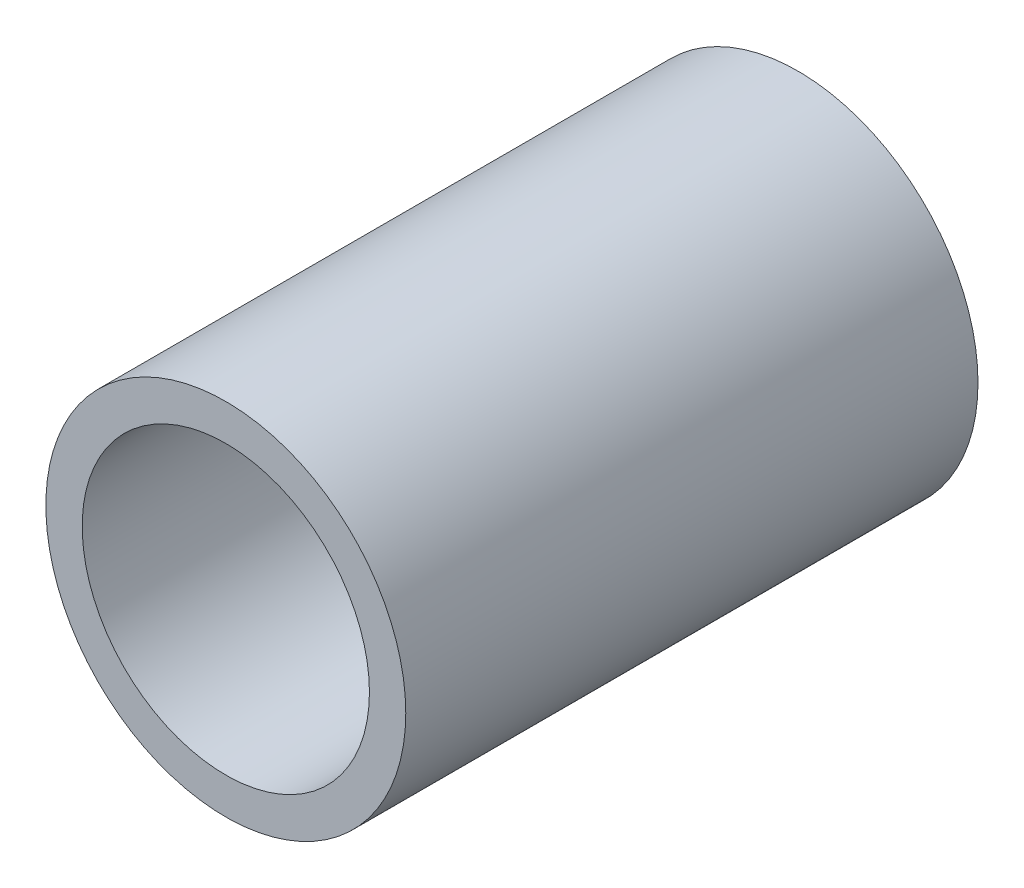
ISO-10303-21;
HEADER;
FILE_DESCRIPTION(('STEP AP214'),'2;1');
FILE_NAME('part.step','',(''),(''),'','','');
FILE_SCHEMA(('AUTOMOTIVE_DESIGN { 1 0 10303 214 1 1 1 1 }'));
ENDSEC;
DATA;
#1=APPLICATION_CONTEXT('core data for automotive mechanical design processes');
#2=APPLICATION_PROTOCOL_DEFINITION('international standard','automotive_design',2000,#1);
#3=PRODUCT_CONTEXT('',#1,'mechanical');
#4=PRODUCT('Part','Part','',(#3));
#5=PRODUCT_RELATED_PRODUCT_CATEGORY('part','',(#4));
#6=PRODUCT_DEFINITION_FORMATION('','',#4);
#7=PRODUCT_DEFINITION_CONTEXT('part definition',#1,'design');
#8=PRODUCT_DEFINITION('design','',#6,#7);
#9=PRODUCT_DEFINITION_SHAPE('','',#8);
#10=(LENGTH_UNIT() NAMED_UNIT(*) SI_UNIT(.MILLI.,.METRE.));
#11=(NAMED_UNIT(*) PLANE_ANGLE_UNIT() SI_UNIT($,.RADIAN.));
#12=(NAMED_UNIT(*) SI_UNIT($,.STERADIAN.) SOLID_ANGLE_UNIT());
#13=UNCERTAINTY_MEASURE_WITH_UNIT(LENGTH_MEASURE(1.E-05),#10,'distance_accuracy_value','');
#14=(GEOMETRIC_REPRESENTATION_CONTEXT(3) GLOBAL_UNCERTAINTY_ASSIGNED_CONTEXT((#13)) GLOBAL_UNIT_ASSIGNED_CONTEXT((#10,
#11,#12)) REPRESENTATION_CONTEXT('',''));
#15=CARTESIAN_POINT('',(0.,0.,0.));
#16=DIRECTION('',(0.,0.,1.));
#17=DIRECTION('',(1.,0.,0.));
#18=AXIS2_PLACEMENT_3D('',#15,#16,#17);
#19=CARTESIAN_POINT('',(0.,0.,6.35));
#20=DIRECTION('',(0.,0.,1.));
#21=DIRECTION('',(1.,0.,0.));
#22=AXIS2_PLACEMENT_3D('',#19,#20,#21);
#23=PLANE('',#22);
#24=CARTESIAN_POINT('',(0.,0.,6.35));
#25=DIRECTION('',(0.,0.,1.));
#26=DIRECTION('',(1.,0.,0.));
#27=AXIS2_PLACEMENT_3D('',#24,#25,#26);
#28=CIRCLE('',#27,3.99415);
#29=CARTESIAN_POINT('',(3.99415,0.,6.35));
#30=VERTEX_POINT('',#29);
#31=EDGE_CURVE('E10',#30,#30,#28,.T.);
#32=ORIENTED_EDGE('',*,*,#31,.T.);
#33=EDGE_LOOP('',(#32));
#34=FACE_BOUND('',#33,.T.);
#35=CARTESIAN_POINT('',(0.,0.,6.35));
#36=DIRECTION('',(0.,0.,1.));
#37=DIRECTION('',(1.,0.,0.));
#38=AXIS2_PLACEMENT_3D('',#35,#36,#37);
#39=CIRCLE('',#38,3.1877);
#40=CARTESIAN_POINT('',(3.1877,0.,6.35));
#41=VERTEX_POINT('',#40);
#42=EDGE_CURVE('E41',#41,#41,#39,.T.);
#43=ORIENTED_EDGE('',*,*,#42,.F.);
#44=EDGE_LOOP('',(#43));
#45=FACE_BOUND('',#44,.T.);
#46=ADVANCED_FACE('F30',(#34,#45),#23,.T.);
#47=CARTESIAN_POINT('',(0.,0.,-6.35));
#48=DIRECTION('',(0.,0.,1.));
#49=DIRECTION('',(1.,0.,0.));
#50=AXIS2_PLACEMENT_3D('',#47,#48,#49);
#51=PLANE('',#50);
#52=CARTESIAN_POINT('',(0.,0.,-6.35));
#53=DIRECTION('',(0.,0.,1.));
#54=DIRECTION('',(1.,0.,0.));
#55=AXIS2_PLACEMENT_3D('',#52,#53,#54);
#56=CIRCLE('',#55,3.99415);
#57=CARTESIAN_POINT('',(3.99415,0.,-6.35));
#58=VERTEX_POINT('',#57);
#59=EDGE_CURVE('E34',#58,#58,#56,.T.);
#60=ORIENTED_EDGE('',*,*,#59,.F.);
#61=EDGE_LOOP('',(#60));
#62=FACE_BOUND('',#61,.T.);
#63=CARTESIAN_POINT('',(0.,0.,-6.35));
#64=DIRECTION('',(0.,0.,1.));
#65=DIRECTION('',(1.,0.,0.));
#66=AXIS2_PLACEMENT_3D('',#63,#64,#65);
#67=CIRCLE('',#66,3.1877);
#68=CARTESIAN_POINT('',(3.1877,0.,-6.35));
#69=VERTEX_POINT('',#68);
#70=EDGE_CURVE('E43',#69,#69,#67,.T.);
#71=ORIENTED_EDGE('',*,*,#70,.T.);
#72=EDGE_LOOP('',(#71));
#73=FACE_BOUND('',#72,.T.);
#74=ADVANCED_FACE('F53',(#62,#73),#51,.F.);
#75=CARTESIAN_POINT('',(0.,0.,6.35));
#76=DIRECTION('',(0.,0.,-1.));
#77=DIRECTION('',(-1.,0.,0.));
#78=AXIS2_PLACEMENT_3D('',#75,#76,#77);
#79=CYLINDRICAL_SURFACE('',#78,3.99415);
#80=ORIENTED_EDGE('',*,*,#31,.F.);
#81=EDGE_LOOP('',(#80));
#82=FACE_BOUND('',#81,.T.);
#83=ORIENTED_EDGE('',*,*,#59,.T.);
#84=EDGE_LOOP('',(#83));
#85=FACE_BOUND('',#84,.T.);
#86=ADVANCED_FACE('F32',(#82,#85),#79,.T.);
#87=CARTESIAN_POINT('',(0.,0.,6.35));
#88=DIRECTION('',(0.,0.,-1.));
#89=DIRECTION('',(-1.,0.,0.));
#90=AXIS2_PLACEMENT_3D('',#87,#88,#89);
#91=CYLINDRICAL_SURFACE('',#90,3.1877);
#92=ORIENTED_EDGE('',*,*,#42,.T.);
#93=EDGE_LOOP('',(#92));
#94=FACE_BOUND('',#93,.T.);
#95=ORIENTED_EDGE('',*,*,#70,.F.);
#96=EDGE_LOOP('',(#95));
#97=FACE_BOUND('',#96,.T.);
#98=ADVANCED_FACE('F49',(#94,#97),#91,.F.);
#99=CLOSED_SHELL('',(#46,#74,#86,#98));
#100=MANIFOLD_SOLID_BREP('B2',#99);
#101=ADVANCED_BREP_SHAPE_REPRESENTATION('',(#18,#100),#14);
#102=SHAPE_DEFINITION_REPRESENTATION(#9,#101);
ENDSEC;
END-ISO-10303-21;
